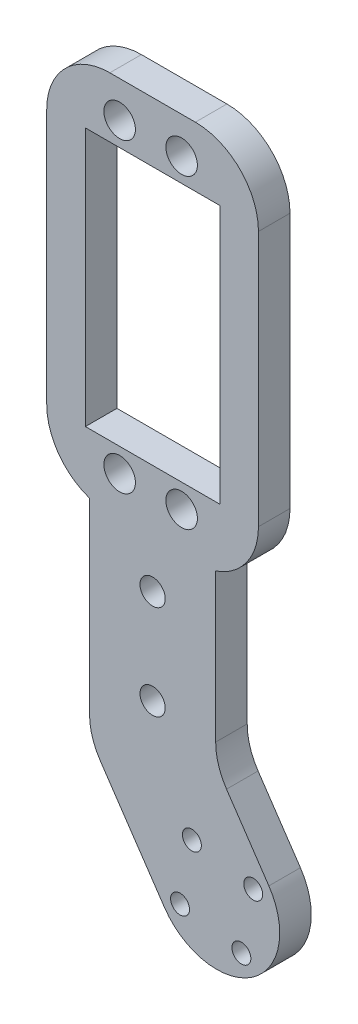
ISO-10303-21;
HEADER;
FILE_DESCRIPTION(('STEP AP214'),'2;1');
FILE_NAME('part.step','',(''),(''),'','','');
FILE_SCHEMA(('AUTOMOTIVE_DESIGN { 1 0 10303 214 1 1 1 1 }'));
ENDSEC;
DATA;
#1=APPLICATION_CONTEXT('core data for automotive mechanical design processes');
#2=APPLICATION_PROTOCOL_DEFINITION('international standard','automotive_design',2000,#1);
#3=PRODUCT_CONTEXT('',#1,'mechanical');
#4=PRODUCT('Part','Part','',(#3));
#5=PRODUCT_RELATED_PRODUCT_CATEGORY('part','',(#4));
#6=PRODUCT_DEFINITION_FORMATION('','',#4);
#7=PRODUCT_DEFINITION_CONTEXT('part definition',#1,'design');
#8=PRODUCT_DEFINITION('design','',#6,#7);
#9=PRODUCT_DEFINITION_SHAPE('','',#8);
#10=(LENGTH_UNIT() NAMED_UNIT(*) SI_UNIT(.MILLI.,.METRE.));
#11=(NAMED_UNIT(*) PLANE_ANGLE_UNIT() SI_UNIT($,.RADIAN.));
#12=(NAMED_UNIT(*) SI_UNIT($,.STERADIAN.) SOLID_ANGLE_UNIT());
#13=UNCERTAINTY_MEASURE_WITH_UNIT(LENGTH_MEASURE(1.E-05),#10,'distance_accuracy_value','');
#14=(GEOMETRIC_REPRESENTATION_CONTEXT(3) GLOBAL_UNCERTAINTY_ASSIGNED_CONTEXT((#13)) GLOBAL_UNIT_ASSIGNED_CONTEXT((#10,
#11,#12)) REPRESENTATION_CONTEXT('',''));
#15=CARTESIAN_POINT('',(0.,0.,0.));
#16=DIRECTION('',(0.,0.,1.));
#17=DIRECTION('',(1.,0.,0.));
#18=AXIS2_PLACEMENT_3D('',#15,#16,#17);
#19=CARTESIAN_POINT('',(-8.28208039522741,-5.60420773410388,5.));
#20=DIRECTION('',(0.828208039522741,0.560420773410388,0.));
#21=DIRECTION('',(-0.560420773410388,0.828208039522741,0.));
#22=AXIS2_PLACEMENT_3D('',#19,#20,#21);
#23=PLANE('',#22);
#24=DIRECTION('',(0.560420773410388,-0.828208039522741,0.));
#25=VECTOR('',#24,1.);
#26=CARTESIAN_POINT('',(-8.28208039522741,-5.60420773410388,5.));
#27=LINE('',#26,#25);
#28=CARTESIAN_POINT('',(-18.4320803952274,9.39579226589612,5.));
#29=VERTEX_POINT('',#28);
#30=CARTESIAN_POINT('',(-8.28208039522741,-5.60420773410389,5.));
#31=VERTEX_POINT('',#30);
#32=EDGE_CURVE('E236',#29,#31,#27,.T.);
#33=ORIENTED_EDGE('',*,*,#32,.F.);
#34=DIRECTION('',(0.,0.,-1.));
#35=VECTOR('',#34,1.);
#36=CARTESIAN_POINT('',(-18.4320803952274,9.39579226589612,0.));
#37=LINE('',#36,#35);
#38=CARTESIAN_POINT('',(-18.4320803952274,9.39579226589612,0.));
#39=VERTEX_POINT('',#38);
#40=EDGE_CURVE('E307',#29,#39,#37,.T.);
#41=ORIENTED_EDGE('',*,*,#40,.T.);
#42=DIRECTION('',(0.560420773410388,-0.828208039522741,0.));
#43=VECTOR('',#42,1.);
#44=CARTESIAN_POINT('',(-8.28208039522741,-5.60420773410388,0.));
#45=LINE('',#44,#43);
#46=CARTESIAN_POINT('',(-8.28208039522741,-5.60420773410389,0.));
#47=VERTEX_POINT('',#46);
#48=EDGE_CURVE('E235',#39,#47,#45,.T.);
#49=ORIENTED_EDGE('',*,*,#48,.T.);
#50=DIRECTION('',(0.,0.,-1.));
#51=VECTOR('',#50,1.);
#52=CARTESIAN_POINT('',(-8.28208039522741,-5.60420773410389,5.));
#53=LINE('',#52,#51);
#54=EDGE_CURVE('E266',#31,#47,#53,.T.);
#55=ORIENTED_EDGE('',*,*,#54,.F.);
#56=EDGE_LOOP('',(#33,#41,#49,#55));
#57=FACE_BOUND('',#56,.T.);
#58=ADVANCED_FACE('F47',(#57),#23,.F.);
#59=CARTESIAN_POINT('',(0.,0.,5.));
#60=DIRECTION('',(0.,0.,-1.));
#61=DIRECTION('',(-1.,0.,0.));
#62=AXIS2_PLACEMENT_3D('',#59,#60,#61);
#63=CYLINDRICAL_SURFACE('',#62,10.);
#64=CARTESIAN_POINT('',(0.,0.,0.));
#65=DIRECTION('',(0.,0.,1.));
#66=DIRECTION('',(1.,0.,0.));
#67=AXIS2_PLACEMENT_3D('',#64,#65,#66);
#68=CIRCLE('',#67,10.);
#69=CARTESIAN_POINT('',(8.28208039522741,5.60420773410388,0.));
#70=VERTEX_POINT('',#69);
#71=EDGE_CURVE('E253',#47,#70,#68,.T.);
#72=ORIENTED_EDGE('',*,*,#71,.T.);
#73=DIRECTION('',(0.,0.,-1.));
#74=VECTOR('',#73,1.);
#75=CARTESIAN_POINT('',(8.28208039522741,5.60420773410388,5.));
#76=LINE('',#75,#74);
#77=CARTESIAN_POINT('',(8.28208039522741,5.60420773410388,5.));
#78=VERTEX_POINT('',#77);
#79=EDGE_CURVE('E251',#78,#70,#76,.T.);
#80=ORIENTED_EDGE('',*,*,#79,.F.);
#81=CARTESIAN_POINT('',(0.,0.,5.));
#82=DIRECTION('',(0.,0.,1.));
#83=DIRECTION('',(1.,0.,0.));
#84=AXIS2_PLACEMENT_3D('',#81,#82,#83);
#85=CIRCLE('',#84,10.);
#86=EDGE_CURVE('E238',#31,#78,#85,.T.);
#87=ORIENTED_EDGE('',*,*,#86,.F.);
#88=ORIENTED_EDGE('',*,*,#54,.T.);
#89=EDGE_LOOP('',(#72,#80,#87,#88));
#90=FACE_BOUND('',#89,.T.);
#91=ADVANCED_FACE('F371',(#90),#63,.T.);
#92=CARTESIAN_POINT('',(8.28208039522741,5.60420773410388,5.));
#93=DIRECTION('',(0.828208039522741,0.560420773410388,0.));
#94=DIRECTION('',(-0.560420773410388,0.828208039522741,0.));
#95=AXIS2_PLACEMENT_3D('',#92,#93,#94);
#96=PLANE('',#95);
#97=DIRECTION('',(0.560420773410388,-0.828208039522741,0.));
#98=VECTOR('',#97,1.);
#99=CARTESIAN_POINT('',(8.28208039522741,5.60420773410388,0.));
#100=LINE('',#99,#98);
#101=CARTESIAN_POINT('',(1.56791960477259,15.5266128431504,0.));
#102=VERTEX_POINT('',#101);
#103=EDGE_CURVE('E256',#102,#70,#100,.T.);
#104=ORIENTED_EDGE('',*,*,#103,.F.);
#105=DIRECTION('',(0.,0.,-1.));
#106=VECTOR('',#105,1.);
#107=CARTESIAN_POINT('',(1.56791960477259,15.5266128431504,5.));
#108=LINE('',#107,#106);
#109=CARTESIAN_POINT('',(1.56791960477259,15.5266128431504,5.));
#110=VERTEX_POINT('',#109);
#111=EDGE_CURVE('E305',#102,#110,#108,.F.);
#112=ORIENTED_EDGE('',*,*,#111,.T.);
#113=DIRECTION('',(0.560420773410388,-0.828208039522741,0.));
#114=VECTOR('',#113,1.);
#115=CARTESIAN_POINT('',(8.28208039522741,5.60420773410388,5.));
#116=LINE('',#115,#114);
#117=EDGE_CURVE('E242',#110,#78,#116,.T.);
#118=ORIENTED_EDGE('',*,*,#117,.T.);
#119=ORIENTED_EDGE('',*,*,#79,.T.);
#120=EDGE_LOOP('',(#104,#112,#118,#119));
#121=FACE_BOUND('',#120,.T.);
#122=ADVANCED_FACE('F320',(#121),#96,.T.);
#123=CARTESIAN_POINT('',(-0.15,0.,5.));
#124=DIRECTION('',(-1.,0.,0.));
#125=DIRECTION('',(0.,-1.,0.));
#126=AXIS2_PLACEMENT_3D('',#123,#124,#125);
#127=PLANE('',#126);
#128=DIRECTION('',(0.,1.,0.));
#129=VECTOR('',#128,1.);
#130=CARTESIAN_POINT('',(-0.15,0.,5.));
#131=LINE('',#130,#129);
#132=CARTESIAN_POINT('',(-0.15,21.1308205772543,5.));
#133=VERTEX_POINT('',#132);
#134=CARTESIAN_POINT('',(-0.150000000000001,44.6203259783869,5.));
#135=VERTEX_POINT('',#134);
#136=EDGE_CURVE('E244',#133,#135,#131,.T.);
#137=ORIENTED_EDGE('',*,*,#136,.F.);
#138=DIRECTION('',(0.,0.,-1.));
#139=VECTOR('',#138,1.);
#140=CARTESIAN_POINT('',(-0.15,21.1308205772543,5.));
#141=LINE('',#140,#139);
#142=CARTESIAN_POINT('',(-0.15,21.1308205772543,0.));
#143=VERTEX_POINT('',#142);
#144=EDGE_CURVE('E302',#133,#143,#141,.T.);
#145=ORIENTED_EDGE('',*,*,#144,.T.);
#146=DIRECTION('',(0.,1.,0.));
#147=VECTOR('',#146,1.);
#148=CARTESIAN_POINT('',(-0.15,0.,0.));
#149=LINE('',#148,#147);
#150=CARTESIAN_POINT('',(-0.150000000000001,44.6203259783869,0.));
#151=VERTEX_POINT('',#150);
#152=EDGE_CURVE('E258',#143,#151,#149,.T.);
#153=ORIENTED_EDGE('',*,*,#152,.T.);
#154=DIRECTION('',(0.,0.,1.));
#155=VECTOR('',#154,1.);
#156=CARTESIAN_POINT('',(-0.15,44.6203259783869,5.));
#157=LINE('',#156,#155);
#158=EDGE_CURVE('E232',#151,#135,#157,.T.);
#159=ORIENTED_EDGE('',*,*,#158,.T.);
#160=EDGE_LOOP('',(#137,#145,#153,#159));
#161=FACE_BOUND('',#160,.T.);
#162=ADVANCED_FACE('F330',(#161),#127,.F.);
#163=CARTESIAN_POINT('',(0.,104.620325978387,5.));
#164=DIRECTION('',(0.,1.,0.));
#165=DIRECTION('',(0.,0.,1.));
#166=AXIS2_PLACEMENT_3D('',#163,#164,#165);
#167=PLANE('',#166);
#168=DIRECTION('',(1.,0.,0.));
#169=VECTOR('',#168,1.);
#170=CARTESIAN_POINT('',(0.,104.620325978387,0.));
#171=LINE('',#170,#169);
#172=CARTESIAN_POINT('',(-16.9293075053698,104.620325978387,0.));
#173=VERTEX_POINT('',#172);
#174=CARTESIAN_POINT('',(-3.37069249463012,104.620325978387,0.));
#175=VERTEX_POINT('',#174);
#176=EDGE_CURVE('E260',#173,#175,#171,.T.);
#177=ORIENTED_EDGE('',*,*,#176,.F.);
#178=DIRECTION('',(0.,0.,1.));
#179=VECTOR('',#178,1.);
#180=CARTESIAN_POINT('',(-16.9293075053698,104.620325978387,5.));
#181=LINE('',#180,#179);
#182=CARTESIAN_POINT('',(-16.9293075053698,104.620325978387,5.));
#183=VERTEX_POINT('',#182);
#184=EDGE_CURVE('E271',#173,#183,#181,.T.);
#185=ORIENTED_EDGE('',*,*,#184,.T.);
#186=DIRECTION('',(1.,0.,0.));
#187=VECTOR('',#186,1.);
#188=CARTESIAN_POINT('',(0.,104.620325978387,5.));
#189=LINE('',#188,#187);
#190=CARTESIAN_POINT('',(-3.37069249463012,104.620325978387,5.));
#191=VERTEX_POINT('',#190);
#192=EDGE_CURVE('E246',#183,#191,#189,.T.);
#193=ORIENTED_EDGE('',*,*,#192,.T.);
#194=DIRECTION('',(0.,0.,1.));
#195=VECTOR('',#194,1.);
#196=CARTESIAN_POINT('',(-3.37069249463012,104.620325978387,5.));
#197=LINE('',#196,#195);
#198=EDGE_CURVE('E269',#191,#175,#197,.F.);
#199=ORIENTED_EDGE('',*,*,#198,.T.);
#200=EDGE_LOOP('',(#177,#185,#193,#199));
#201=FACE_BOUND('',#200,.T.);
#202=ADVANCED_FACE('F348',(#201),#167,.T.);
#203=CARTESIAN_POINT('',(-20.15,0.,5.));
#204=DIRECTION('',(-1.,0.,0.));
#205=DIRECTION('',(0.,0.,1.));
#206=AXIS2_PLACEMENT_3D('',#203,#204,#205);
#207=PLANE('',#206);
#208=DIRECTION('',(0.,1.,0.));
#209=VECTOR('',#208,1.);
#210=CARTESIAN_POINT('',(-20.15,0.,0.));
#211=LINE('',#210,#209);
#212=CARTESIAN_POINT('',(-20.15,15.,0.));
#213=VERTEX_POINT('',#212);
#214=CARTESIAN_POINT('',(-20.15,44.6203259783869,0.));
#215=VERTEX_POINT('',#214);
#216=EDGE_CURVE('E239',#213,#215,#211,.T.);
#217=ORIENTED_EDGE('',*,*,#216,.F.);
#218=DIRECTION('',(0.,0.,-1.));
#219=VECTOR('',#218,1.);
#220=CARTESIAN_POINT('',(-20.15,15.,5.));
#221=LINE('',#220,#219);
#222=CARTESIAN_POINT('',(-20.15,15.,5.));
#223=VERTEX_POINT('',#222);
#224=EDGE_CURVE('E62',#213,#223,#221,.F.);
#225=ORIENTED_EDGE('',*,*,#224,.T.);
#226=DIRECTION('',(0.,1.,0.));
#227=VECTOR('',#226,1.);
#228=CARTESIAN_POINT('',(-20.15,0.,5.));
#229=LINE('',#228,#227);
#230=CARTESIAN_POINT('',(-20.15,44.6203259783869,5.));
#231=VERTEX_POINT('',#230);
#232=EDGE_CURVE('E249',#223,#231,#229,.T.);
#233=ORIENTED_EDGE('',*,*,#232,.T.);
#234=DIRECTION('',(0.,0.,1.));
#235=VECTOR('',#234,1.);
#236=CARTESIAN_POINT('',(-20.15,44.6203259783869,5.));
#237=LINE('',#236,#235);
#238=EDGE_CURVE('E225',#215,#231,#237,.T.);
#239=ORIENTED_EDGE('',*,*,#238,.F.);
#240=EDGE_LOOP('',(#217,#225,#233,#239));
#241=FACE_BOUND('',#240,.T.);
#242=ADVANCED_FACE('F456',(#241),#207,.T.);
#243=CARTESIAN_POINT('',(0.,0.,5.));
#244=DIRECTION('',(0.,0.,1.));
#245=DIRECTION('',(1.,0.,0.));
#246=AXIS2_PLACEMENT_3D('',#243,#244,#245);
#247=PLANE('',#246);
#248=CARTESIAN_POINT('',(5.7974562766592,3.9229454138727,5.));
#249=DIRECTION('',(0.,0.,1.));
#250=DIRECTION('',(1.,0.,0.));
#251=AXIS2_PLACEMENT_3D('',#248,#249,#250);
#252=CIRCLE('',#251,1.5);
#253=CARTESIAN_POINT('',(7.2974562766592,3.9229454138727,5.));
#254=VERTEX_POINT('',#253);
#255=EDGE_CURVE('E725',#254,#254,#252,.T.);
#256=ORIENTED_EDGE('',*,*,#255,.F.);
#257=EDGE_LOOP('',(#256));
#258=FACE_BOUND('',#257,.T.);
#259=CARTESIAN_POINT('',(3.92294541387272,-5.79745627665919,5.));
#260=DIRECTION('',(0.,0.,1.));
#261=DIRECTION('',(1.,0.,0.));
#262=AXIS2_PLACEMENT_3D('',#259,#260,#261);
#263=CIRCLE('',#262,1.5);
#264=CARTESIAN_POINT('',(5.42294541387272,-5.79745627665919,5.));
#265=VERTEX_POINT('',#264);
#266=EDGE_CURVE('E721',#265,#265,#263,.T.);
#267=ORIENTED_EDGE('',*,*,#266,.F.);
#268=EDGE_LOOP('',(#267));
#269=FACE_BOUND('',#268,.T.);
#270=CARTESIAN_POINT('',(-5.79745627665891,-3.92294541387277,5.));
#271=DIRECTION('',(0.,0.,1.));
#272=DIRECTION('',(1.,0.,0.));
#273=AXIS2_PLACEMENT_3D('',#270,#271,#272);
#274=CIRCLE('',#273,1.5);
#275=CARTESIAN_POINT('',(-4.29745627665891,-3.92294541387277,5.));
#276=VERTEX_POINT('',#275);
#277=EDGE_CURVE('E717',#276,#276,#274,.T.);
#278=ORIENTED_EDGE('',*,*,#277,.F.);
#279=EDGE_LOOP('',(#278));
#280=FACE_BOUND('',#279,.T.);
#281=CARTESIAN_POINT('',(-10.15,21.7974562766592,5.));
#282=DIRECTION('',(0.,0.,1.));
#283=DIRECTION('',(1.,0.,0.));
#284=AXIS2_PLACEMENT_3D('',#281,#282,#283);
#285=CIRCLE('',#284,2.);
#286=CARTESIAN_POINT('',(-8.14999999999999,21.7974562766592,5.));
#287=VERTEX_POINT('',#286);
#288=EDGE_CURVE('E713',#287,#287,#285,.T.);
#289=ORIENTED_EDGE('',*,*,#288,.F.);
#290=EDGE_LOOP('',(#289));
#291=FACE_BOUND('',#290,.T.);
#292=CARTESIAN_POINT('',(-10.15,36.7974562766592,5.));
#293=DIRECTION('',(0.,0.,1.));
#294=DIRECTION('',(1.,0.,0.));
#295=AXIS2_PLACEMENT_3D('',#292,#293,#294);
#296=CIRCLE('',#295,2.);
#297=CARTESIAN_POINT('',(-8.15,36.7974562766592,5.));
#298=VERTEX_POINT('',#297);
#299=EDGE_CURVE('E709',#298,#298,#296,.T.);
#300=ORIENTED_EDGE('',*,*,#299,.F.);
#301=EDGE_LOOP('',(#300));
#302=FACE_BOUND('',#301,.T.);
#303=CARTESIAN_POINT('',(-3.92294541387272,5.79745627665919,5.));
#304=DIRECTION('',(0.,0.,1.));
#305=DIRECTION('',(1.,0.,0.));
#306=AXIS2_PLACEMENT_3D('',#303,#304,#305);
#307=CIRCLE('',#306,1.5);
#308=CARTESIAN_POINT('',(-2.42294541387272,5.79745627665919,5.));
#309=VERTEX_POINT('',#308);
#310=EDGE_CURVE('E705',#309,#309,#307,.T.);
#311=ORIENTED_EDGE('',*,*,#310,.F.);
#312=EDGE_LOOP('',(#311));
#313=FACE_BOUND('',#312,.T.);
#314=CARTESIAN_POINT('',(-15.3737237098508,50.3703259783869,5.));
#315=DIRECTION('',(0.,0.,1.));
#316=DIRECTION('',(1.,0.,0.));
#317=AXIS2_PLACEMENT_3D('',#314,#315,#316);
#318=CIRCLE('',#317,2.5);
#319=CARTESIAN_POINT('',(-12.8737237098508,50.3703259783869,5.));
#320=VERTEX_POINT('',#319);
#321=EDGE_CURVE('E701',#320,#320,#318,.T.);
#322=ORIENTED_EDGE('',*,*,#321,.F.);
#323=EDGE_LOOP('',(#322));
#324=FACE_BOUND('',#323,.T.);
#325=CARTESIAN_POINT('',(-5.54999999999958,50.3703259783869,5.));
#326=DIRECTION('',(0.,0.,1.));
#327=DIRECTION('',(1.,0.,0.));
#328=AXIS2_PLACEMENT_3D('',#325,#326,#327);
#329=CIRCLE('',#328,2.50000000000012);
#330=CARTESIAN_POINT('',(-3.04999999999946,50.3703259783869,5.));
#331=VERTEX_POINT('',#330);
#332=EDGE_CURVE('E697',#331,#331,#329,.T.);
#333=ORIENTED_EDGE('',*,*,#332,.F.);
#334=EDGE_LOOP('',(#333));
#335=FACE_BOUND('',#334,.T.);
#336=CARTESIAN_POINT('',(-15.3737237098508,98.8703259783869,5.));
#337=DIRECTION('',(0.,0.,1.));
#338=DIRECTION('',(1.,0.,0.));
#339=AXIS2_PLACEMENT_3D('',#336,#337,#338);
#340=CIRCLE('',#339,2.49999999999999);
#341=CARTESIAN_POINT('',(-12.8737237098508,98.8703259783869,5.));
#342=VERTEX_POINT('',#341);
#343=EDGE_CURVE('E691',#342,#342,#340,.T.);
#344=ORIENTED_EDGE('',*,*,#343,.F.);
#345=EDGE_LOOP('',(#344));
#346=FACE_BOUND('',#345,.T.);
#347=CARTESIAN_POINT('',(-5.54999999999958,98.8703259783869,5.));
#348=DIRECTION('',(0.,0.,1.));
#349=DIRECTION('',(1.,0.,0.));
#350=AXIS2_PLACEMENT_3D('',#347,#348,#349);
#351=CIRCLE('',#350,2.5);
#352=CARTESIAN_POINT('',(-3.04999999999958,98.8703259783869,5.));
#353=VERTEX_POINT('',#352);
#354=EDGE_CURVE('E201',#353,#353,#351,.T.);
#355=ORIENTED_EDGE('',*,*,#354,.F.);
#356=EDGE_LOOP('',(#355));
#357=FACE_BOUND('',#356,.T.);
#358=DIRECTION('',(0.,-1.,0.));
#359=VECTOR('',#358,1.);
#360=CARTESIAN_POINT('',(-20.8,54.1203259783869,5.));
#361=LINE('',#360,#359);
#362=CARTESIAN_POINT('',(-20.8,95.1203259783869,5.));
#363=VERTEX_POINT('',#362);
#364=CARTESIAN_POINT('',(-20.8,54.1203259783869,5.));
#365=VERTEX_POINT('',#364);
#366=EDGE_CURVE('E178',#363,#365,#361,.T.);
#367=ORIENTED_EDGE('',*,*,#366,.F.);
#368=DIRECTION('',(-1.,0.,0.));
#369=VECTOR('',#368,1.);
#370=CARTESIAN_POINT('',(0.499999999999995,95.1203259783869,5.));
#371=LINE('',#370,#369);
#372=CARTESIAN_POINT('',(0.499999999999995,95.1203259783869,5.));
#373=VERTEX_POINT('',#372);
#374=EDGE_CURVE('E195',#373,#363,#371,.T.);
#375=ORIENTED_EDGE('',*,*,#374,.F.);
#376=DIRECTION('',(0.,1.,0.));
#377=VECTOR('',#376,1.);
#378=CARTESIAN_POINT('',(0.500000000000005,54.1203259783869,5.));
#379=LINE('',#378,#377);
#380=CARTESIAN_POINT('',(0.500000000000005,54.1203259783869,5.));
#381=VERTEX_POINT('',#380);
#382=EDGE_CURVE('E198',#381,#373,#379,.T.);
#383=ORIENTED_EDGE('',*,*,#382,.F.);
#384=DIRECTION('',(1.,0.,0.));
#385=VECTOR('',#384,1.);
#386=CARTESIAN_POINT('',(0.500000000000005,54.1203259783869,5.));
#387=LINE('',#386,#385);
#388=EDGE_CURVE('E207',#365,#381,#387,.T.);
#389=ORIENTED_EDGE('',*,*,#388,.F.);
#390=EDGE_LOOP('',(#367,#375,#383,#389));
#391=FACE_BOUND('',#390,.T.);
#392=ORIENTED_EDGE('',*,*,#232,.F.);
#393=CARTESIAN_POINT('',(-10.15,15.,5.));
#394=DIRECTION('',(0.,0.,1.));
#395=DIRECTION('',(1.,0.,0.));
#396=AXIS2_PLACEMENT_3D('',#393,#394,#395);
#397=CIRCLE('',#396,10.);
#398=EDGE_CURVE('E312',#223,#29,#397,.T.);
#399=ORIENTED_EDGE('',*,*,#398,.T.);
#400=ORIENTED_EDGE('',*,*,#32,.T.);
#401=ORIENTED_EDGE('',*,*,#86,.T.);
#402=ORIENTED_EDGE('',*,*,#117,.F.);
#403=CARTESIAN_POINT('',(9.85,21.1308205772543,5.));
#404=DIRECTION('',(0.,0.,1.));
#405=DIRECTION('',(1.,0.,0.));
#406=AXIS2_PLACEMENT_3D('',#403,#404,#405);
#407=CIRCLE('',#406,10.);
#408=EDGE_CURVE('E13',#110,#133,#407,.F.);
#409=ORIENTED_EDGE('',*,*,#408,.T.);
#410=ORIENTED_EDGE('',*,*,#136,.T.);
#411=CARTESIAN_POINT('',(-3.37069249463012,54.0874871080515,5.));
#412=DIRECTION('',(0.,0.,1.));
#413=DIRECTION('',(1.,0.,0.));
#414=AXIS2_PLACEMENT_3D('',#411,#412,#413);
#415=CIRCLE('',#414,10.);
#416=CARTESIAN_POINT('',(6.62930750536989,54.0874871080515,5.));
#417=VERTEX_POINT('',#416);
#418=EDGE_CURVE('E277',#135,#417,#415,.T.);
#419=ORIENTED_EDGE('',*,*,#418,.T.);
#420=DIRECTION('',(0.,1.,0.));
#421=VECTOR('',#420,1.);
#422=CARTESIAN_POINT('',(6.62930750536989,44.6203259783869,5.));
#423=LINE('',#422,#421);
#424=CARTESIAN_POINT('',(6.62930750536989,94.6203259783869,5.));
#425=VERTEX_POINT('',#424);
#426=EDGE_CURVE('E222',#417,#425,#423,.T.);
#427=ORIENTED_EDGE('',*,*,#426,.T.);
#428=CARTESIAN_POINT('',(-3.37069249463012,94.6203259783869,5.));
#429=DIRECTION('',(0.,0.,1.));
#430=DIRECTION('',(1.,0.,0.));
#431=AXIS2_PLACEMENT_3D('',#428,#429,#430);
#432=CIRCLE('',#431,10.);
#433=EDGE_CURVE('E279',#425,#191,#432,.T.);
#434=ORIENTED_EDGE('',*,*,#433,.T.);
#435=ORIENTED_EDGE('',*,*,#192,.F.);
#436=CARTESIAN_POINT('',(-16.9293075053698,94.6203259783869,5.));
#437=DIRECTION('',(0.,0.,1.));
#438=DIRECTION('',(1.,0.,0.));
#439=AXIS2_PLACEMENT_3D('',#436,#437,#438);
#440=CIRCLE('',#439,10.);
#441=CARTESIAN_POINT('',(-26.9293075053698,94.6203259783869,5.));
#442=VERTEX_POINT('',#441);
#443=EDGE_CURVE('E281',#183,#442,#440,.T.);
#444=ORIENTED_EDGE('',*,*,#443,.T.);
#445=DIRECTION('',(0.,-1.,0.));
#446=VECTOR('',#445,1.);
#447=CARTESIAN_POINT('',(-26.9293075053698,44.6203259783869,5.));
#448=LINE('',#447,#446);
#449=CARTESIAN_POINT('',(-26.9293075053698,54.0874871080515,5.));
#450=VERTEX_POINT('',#449);
#451=EDGE_CURVE('E214',#442,#450,#448,.T.);
#452=ORIENTED_EDGE('',*,*,#451,.T.);
#453=CARTESIAN_POINT('',(-16.9293075053698,54.0874871080515,5.));
#454=DIRECTION('',(0.,0.,1.));
#455=DIRECTION('',(1.,0.,0.));
#456=AXIS2_PLACEMENT_3D('',#453,#454,#455);
#457=CIRCLE('',#456,10.);
#458=EDGE_CURVE('E274',#450,#231,#457,.T.);
#459=ORIENTED_EDGE('',*,*,#458,.T.);
#460=EDGE_LOOP('',(#392,#399,#400,#401,#402,#409,#410,#419,#427,#434,#435,#444,#452,#459));
#461=FACE_BOUND('',#460,.T.);
#462=ADVANCED_FACE('F327',(#258,#269,#280,#291,#302,#313,#324,#335,#346,#357,#391,#461),#247,.T.);
#463=CARTESIAN_POINT('',(0.,0.,0.));
#464=DIRECTION('',(0.,0.,1.));
#465=DIRECTION('',(1.,0.,0.));
#466=AXIS2_PLACEMENT_3D('',#463,#464,#465);
#467=PLANE('',#466);
#468=CARTESIAN_POINT('',(5.7974562766592,3.9229454138727,0.));
#469=DIRECTION('',(0.,0.,1.));
#470=DIRECTION('',(1.,0.,0.));
#471=AXIS2_PLACEMENT_3D('',#468,#469,#470);
#472=CIRCLE('',#471,1.5);
#473=CARTESIAN_POINT('',(7.2974562766592,3.9229454138727,0.));
#474=VERTEX_POINT('',#473);
#475=EDGE_CURVE('E656',#474,#474,#472,.T.);
#476=ORIENTED_EDGE('',*,*,#475,.T.);
#477=EDGE_LOOP('',(#476));
#478=FACE_BOUND('',#477,.T.);
#479=CARTESIAN_POINT('',(3.92294541387272,-5.79745627665919,0.));
#480=DIRECTION('',(0.,0.,1.));
#481=DIRECTION('',(1.,0.,0.));
#482=AXIS2_PLACEMENT_3D('',#479,#480,#481);
#483=CIRCLE('',#482,1.5);
#484=CARTESIAN_POINT('',(5.42294541387272,-5.79745627665919,0.));
#485=VERTEX_POINT('',#484);
#486=EDGE_CURVE('E660',#485,#485,#483,.T.);
#487=ORIENTED_EDGE('',*,*,#486,.T.);
#488=EDGE_LOOP('',(#487));
#489=FACE_BOUND('',#488,.T.);
#490=CARTESIAN_POINT('',(-5.79745627665891,-3.92294541387277,0.));
#491=DIRECTION('',(0.,0.,1.));
#492=DIRECTION('',(1.,0.,0.));
#493=AXIS2_PLACEMENT_3D('',#490,#491,#492);
#494=CIRCLE('',#493,1.5);
#495=CARTESIAN_POINT('',(-4.29745627665891,-3.92294541387277,0.));
#496=VERTEX_POINT('',#495);
#497=EDGE_CURVE('E664',#496,#496,#494,.T.);
#498=ORIENTED_EDGE('',*,*,#497,.T.);
#499=EDGE_LOOP('',(#498));
#500=FACE_BOUND('',#499,.T.);
#501=CARTESIAN_POINT('',(-10.15,21.7974562766592,0.));
#502=DIRECTION('',(0.,0.,1.));
#503=DIRECTION('',(1.,0.,0.));
#504=AXIS2_PLACEMENT_3D('',#501,#502,#503);
#505=CIRCLE('',#504,2.);
#506=CARTESIAN_POINT('',(-8.14999999999999,21.7974562766592,0.));
#507=VERTEX_POINT('',#506);
#508=EDGE_CURVE('E668',#507,#507,#505,.T.);
#509=ORIENTED_EDGE('',*,*,#508,.T.);
#510=EDGE_LOOP('',(#509));
#511=FACE_BOUND('',#510,.T.);
#512=CARTESIAN_POINT('',(-10.15,36.7974562766592,0.));
#513=DIRECTION('',(0.,0.,1.));
#514=DIRECTION('',(1.,0.,0.));
#515=AXIS2_PLACEMENT_3D('',#512,#513,#514);
#516=CIRCLE('',#515,2.);
#517=CARTESIAN_POINT('',(-8.15,36.7974562766592,0.));
#518=VERTEX_POINT('',#517);
#519=EDGE_CURVE('E672',#518,#518,#516,.T.);
#520=ORIENTED_EDGE('',*,*,#519,.T.);
#521=EDGE_LOOP('',(#520));
#522=FACE_BOUND('',#521,.T.);
#523=CARTESIAN_POINT('',(-3.92294541387272,5.79745627665919,0.));
#524=DIRECTION('',(0.,0.,1.));
#525=DIRECTION('',(1.,0.,0.));
#526=AXIS2_PLACEMENT_3D('',#523,#524,#525);
#527=CIRCLE('',#526,1.5);
#528=CARTESIAN_POINT('',(-2.42294541387272,5.79745627665919,0.));
#529=VERTEX_POINT('',#528);
#530=EDGE_CURVE('E676',#529,#529,#527,.T.);
#531=ORIENTED_EDGE('',*,*,#530,.T.);
#532=EDGE_LOOP('',(#531));
#533=FACE_BOUND('',#532,.T.);
#534=CARTESIAN_POINT('',(-15.3737237098508,50.3703259783869,0.));
#535=DIRECTION('',(0.,0.,1.));
#536=DIRECTION('',(1.,0.,0.));
#537=AXIS2_PLACEMENT_3D('',#534,#535,#536);
#538=CIRCLE('',#537,2.5);
#539=CARTESIAN_POINT('',(-12.8737237098508,50.3703259783869,0.));
#540=VERTEX_POINT('',#539);
#541=EDGE_CURVE('E208',#540,#540,#538,.T.);
#542=ORIENTED_EDGE('',*,*,#541,.T.);
#543=EDGE_LOOP('',(#542));
#544=FACE_BOUND('',#543,.T.);
#545=CARTESIAN_POINT('',(-5.54999999999958,50.3703259783869,0.));
#546=DIRECTION('',(0.,0.,1.));
#547=DIRECTION('',(1.,0.,0.));
#548=AXIS2_PLACEMENT_3D('',#545,#546,#547);
#549=CIRCLE('',#548,2.50000000000012);
#550=CARTESIAN_POINT('',(-3.04999999999946,50.3703259783869,0.));
#551=VERTEX_POINT('',#550);
#552=EDGE_CURVE('E683',#551,#551,#549,.T.);
#553=ORIENTED_EDGE('',*,*,#552,.T.);
#554=EDGE_LOOP('',(#553));
#555=FACE_BOUND('',#554,.T.);
#556=CARTESIAN_POINT('',(-15.3737237098508,98.8703259783869,0.));
#557=DIRECTION('',(0.,0.,1.));
#558=DIRECTION('',(1.,0.,0.));
#559=AXIS2_PLACEMENT_3D('',#556,#557,#558);
#560=CIRCLE('',#559,2.49999999999999);
#561=CARTESIAN_POINT('',(-12.8737237098508,98.8703259783869,0.));
#562=VERTEX_POINT('',#561);
#563=EDGE_CURVE('E687',#562,#562,#560,.T.);
#564=ORIENTED_EDGE('',*,*,#563,.T.);
#565=EDGE_LOOP('',(#564));
#566=FACE_BOUND('',#565,.T.);
#567=CARTESIAN_POINT('',(-5.54999999999958,98.8703259783869,0.));
#568=DIRECTION('',(0.,0.,1.));
#569=DIRECTION('',(1.,0.,0.));
#570=AXIS2_PLACEMENT_3D('',#567,#568,#569);
#571=CIRCLE('',#570,2.5);
#572=CARTESIAN_POINT('',(-3.04999999999958,98.8703259783869,0.));
#573=VERTEX_POINT('',#572);
#574=EDGE_CURVE('E690',#573,#573,#571,.T.);
#575=ORIENTED_EDGE('',*,*,#574,.T.);
#576=EDGE_LOOP('',(#575));
#577=FACE_BOUND('',#576,.T.);
#578=DIRECTION('',(-1.,0.,0.));
#579=VECTOR('',#578,1.);
#580=CARTESIAN_POINT('',(0.499999999999995,95.1203259783869,0.));
#581=LINE('',#580,#579);
#582=CARTESIAN_POINT('',(0.499999999999995,95.1203259783869,0.));
#583=VERTEX_POINT('',#582);
#584=CARTESIAN_POINT('',(-20.8,95.1203259783869,0.));
#585=VERTEX_POINT('',#584);
#586=EDGE_CURVE('E183',#583,#585,#581,.T.);
#587=ORIENTED_EDGE('',*,*,#586,.T.);
#588=DIRECTION('',(0.,-1.,0.));
#589=VECTOR('',#588,1.);
#590=CARTESIAN_POINT('',(-20.8,54.1203259783869,0.));
#591=LINE('',#590,#589);
#592=CARTESIAN_POINT('',(-20.8,54.1203259783869,0.));
#593=VERTEX_POINT('',#592);
#594=EDGE_CURVE('E175',#585,#593,#591,.T.);
#595=ORIENTED_EDGE('',*,*,#594,.T.);
#596=DIRECTION('',(1.,0.,0.));
#597=VECTOR('',#596,1.);
#598=CARTESIAN_POINT('',(0.500000000000005,54.1203259783869,0.));
#599=LINE('',#598,#597);
#600=CARTESIAN_POINT('',(0.500000000000005,54.1203259783869,0.));
#601=VERTEX_POINT('',#600);
#602=EDGE_CURVE('E187',#593,#601,#599,.T.);
#603=ORIENTED_EDGE('',*,*,#602,.T.);
#604=DIRECTION('',(0.,1.,0.));
#605=VECTOR('',#604,1.);
#606=CARTESIAN_POINT('',(0.500000000000005,54.1203259783869,0.));
#607=LINE('',#606,#605);
#608=EDGE_CURVE('E191',#601,#583,#607,.T.);
#609=ORIENTED_EDGE('',*,*,#608,.T.);
#610=EDGE_LOOP('',(#587,#595,#603,#609));
#611=FACE_BOUND('',#610,.T.);
#612=ORIENTED_EDGE('',*,*,#48,.F.);
#613=CARTESIAN_POINT('',(-10.15,15.,0.));
#614=DIRECTION('',(0.,0.,1.));
#615=DIRECTION('',(1.,0.,0.));
#616=AXIS2_PLACEMENT_3D('',#613,#614,#615);
#617=CIRCLE('',#616,10.);
#618=EDGE_CURVE('E70',#39,#213,#617,.F.);
#619=ORIENTED_EDGE('',*,*,#618,.T.);
#620=ORIENTED_EDGE('',*,*,#216,.T.);
#621=CARTESIAN_POINT('',(-16.9293075053698,54.0874871080515,0.));
#622=DIRECTION('',(0.,0.,1.));
#623=DIRECTION('',(1.,0.,0.));
#624=AXIS2_PLACEMENT_3D('',#621,#622,#623);
#625=CIRCLE('',#624,10.);
#626=CARTESIAN_POINT('',(-26.9293075053698,54.0874871080515,0.));
#627=VERTEX_POINT('',#626);
#628=EDGE_CURVE('E288',#215,#627,#625,.F.);
#629=ORIENTED_EDGE('',*,*,#628,.T.);
#630=DIRECTION('',(0.,-1.,0.));
#631=VECTOR('',#630,1.);
#632=CARTESIAN_POINT('',(-26.9293075053698,44.6203259783869,0.));
#633=LINE('',#632,#631);
#634=CARTESIAN_POINT('',(-26.9293075053698,94.6203259783869,0.));
#635=VERTEX_POINT('',#634);
#636=EDGE_CURVE('E218',#635,#627,#633,.T.);
#637=ORIENTED_EDGE('',*,*,#636,.F.);
#638=CARTESIAN_POINT('',(-16.9293075053698,94.6203259783869,0.));
#639=DIRECTION('',(0.,0.,1.));
#640=DIRECTION('',(1.,0.,0.));
#641=AXIS2_PLACEMENT_3D('',#638,#639,#640);
#642=CIRCLE('',#641,10.);
#643=EDGE_CURVE('E295',#635,#173,#642,.F.);
#644=ORIENTED_EDGE('',*,*,#643,.T.);
#645=ORIENTED_EDGE('',*,*,#176,.T.);
#646=CARTESIAN_POINT('',(-3.37069249463012,94.6203259783869,0.));
#647=DIRECTION('',(0.,0.,1.));
#648=DIRECTION('',(1.,0.,0.));
#649=AXIS2_PLACEMENT_3D('',#646,#647,#648);
#650=CIRCLE('',#649,10.);
#651=CARTESIAN_POINT('',(6.62930750536989,94.6203259783869,0.));
#652=VERTEX_POINT('',#651);
#653=EDGE_CURVE('E293',#175,#652,#650,.F.);
#654=ORIENTED_EDGE('',*,*,#653,.T.);
#655=DIRECTION('',(0.,1.,0.));
#656=VECTOR('',#655,1.);
#657=CARTESIAN_POINT('',(6.62930750536989,44.6203259783869,0.));
#658=LINE('',#657,#656);
#659=CARTESIAN_POINT('',(6.62930750536989,54.0874871080515,0.));
#660=VERTEX_POINT('',#659);
#661=EDGE_CURVE('E221',#660,#652,#658,.T.);
#662=ORIENTED_EDGE('',*,*,#661,.F.);
#663=CARTESIAN_POINT('',(-3.37069249463012,54.0874871080515,0.));
#664=DIRECTION('',(0.,0.,1.));
#665=DIRECTION('',(1.,0.,0.));
#666=AXIS2_PLACEMENT_3D('',#663,#664,#665);
#667=CIRCLE('',#666,10.);
#668=EDGE_CURVE('E290',#660,#151,#667,.F.);
#669=ORIENTED_EDGE('',*,*,#668,.T.);
#670=ORIENTED_EDGE('',*,*,#152,.F.);
#671=CARTESIAN_POINT('',(9.85,21.1308205772543,0.));
#672=DIRECTION('',(0.,0.,1.));
#673=DIRECTION('',(1.,0.,0.));
#674=AXIS2_PLACEMENT_3D('',#671,#672,#673);
#675=CIRCLE('',#674,10.);
#676=EDGE_CURVE('E55',#143,#102,#675,.T.);
#677=ORIENTED_EDGE('',*,*,#676,.T.);
#678=ORIENTED_EDGE('',*,*,#103,.T.);
#679=ORIENTED_EDGE('',*,*,#71,.F.);
#680=EDGE_LOOP('',(#612,#619,#620,#629,#637,#644,#645,#654,#662,#669,#670,#677,#678,#679));
#681=FACE_BOUND('',#680,.T.);
#682=ADVANCED_FACE('F193',(#478,#489,#500,#511,#522,#533,#544,#555,#566,#577,#611,#681),#467,.F.);
#683=CARTESIAN_POINT('',(-26.9293075053698,44.6203259783869,0.));
#684=DIRECTION('',(-1.,0.,0.));
#685=DIRECTION('',(0.,-1.,0.));
#686=AXIS2_PLACEMENT_3D('',#683,#684,#685);
#687=PLANE('',#686);
#688=ORIENTED_EDGE('',*,*,#451,.F.);
#689=DIRECTION('',(0.,0.,1.));
#690=VECTOR('',#689,1.);
#691=CARTESIAN_POINT('',(-26.9293075053698,94.6203259783869,0.));
#692=LINE('',#691,#690);
#693=EDGE_CURVE('E286',#442,#635,#692,.F.);
#694=ORIENTED_EDGE('',*,*,#693,.T.);
#695=ORIENTED_EDGE('',*,*,#636,.T.);
#696=DIRECTION('',(0.,0.,1.));
#697=VECTOR('',#696,1.);
#698=CARTESIAN_POINT('',(-26.9293075053698,54.0874871080515,5.));
#699=LINE('',#698,#697);
#700=EDGE_CURVE('E283',#627,#450,#699,.T.);
#701=ORIENTED_EDGE('',*,*,#700,.T.);
#702=EDGE_LOOP('',(#688,#694,#695,#701));
#703=FACE_BOUND('',#702,.T.);
#704=ADVANCED_FACE('F356',(#703),#687,.T.);
#705=CARTESIAN_POINT('',(6.62930750536989,44.6203259783869,0.));
#706=DIRECTION('',(1.,0.,0.));
#707=DIRECTION('',(0.,0.,-1.));
#708=AXIS2_PLACEMENT_3D('',#705,#706,#707);
#709=PLANE('',#708);
#710=ORIENTED_EDGE('',*,*,#661,.T.);
#711=DIRECTION('',(0.,0.,1.));
#712=VECTOR('',#711,1.);
#713=CARTESIAN_POINT('',(6.62930750536989,94.6203259783869,0.));
#714=LINE('',#713,#712);
#715=EDGE_CURVE('E299',#652,#425,#714,.T.);
#716=ORIENTED_EDGE('',*,*,#715,.T.);
#717=ORIENTED_EDGE('',*,*,#426,.F.);
#718=DIRECTION('',(0.,0.,1.));
#719=VECTOR('',#718,1.);
#720=CARTESIAN_POINT('',(6.62930750536989,54.0874871080515,0.));
#721=LINE('',#720,#719);
#722=EDGE_CURVE('E297',#417,#660,#721,.F.);
#723=ORIENTED_EDGE('',*,*,#722,.T.);
#724=EDGE_LOOP('',(#710,#716,#717,#723));
#725=FACE_BOUND('',#724,.T.);
#726=ADVANCED_FACE('F338',(#725),#709,.T.);
#727=CARTESIAN_POINT('',(-20.8,54.1203259783869,0.));
#728=DIRECTION('',(-1.,0.,0.));
#729=DIRECTION('',(0.,-1.,0.));
#730=AXIS2_PLACEMENT_3D('',#727,#728,#729);
#731=PLANE('',#730);
#732=ORIENTED_EDGE('',*,*,#366,.T.);
#733=DIRECTION('',(0.,0.,1.));
#734=VECTOR('',#733,1.);
#735=CARTESIAN_POINT('',(-20.8,54.1203259783869,0.));
#736=LINE('',#735,#734);
#737=EDGE_CURVE('E171',#593,#365,#736,.T.);
#738=ORIENTED_EDGE('',*,*,#737,.F.);
#739=ORIENTED_EDGE('',*,*,#594,.F.);
#740=DIRECTION('',(0.,0.,1.));
#741=VECTOR('',#740,1.);
#742=CARTESIAN_POINT('',(-20.8,95.1203259783869,0.));
#743=LINE('',#742,#741);
#744=EDGE_CURVE('E212',#585,#363,#743,.T.);
#745=ORIENTED_EDGE('',*,*,#744,.T.);
#746=EDGE_LOOP('',(#732,#738,#739,#745));
#747=FACE_BOUND('',#746,.T.);
#748=ADVANCED_FACE('F173',(#747),#731,.F.);
#749=CARTESIAN_POINT('',(0.499999999999995,95.1203259783869,0.));
#750=DIRECTION('',(0.,1.,0.));
#751=DIRECTION('',(-1.,0.,0.));
#752=AXIS2_PLACEMENT_3D('',#749,#750,#751);
#753=PLANE('',#752);
#754=ORIENTED_EDGE('',*,*,#374,.T.);
#755=ORIENTED_EDGE('',*,*,#744,.F.);
#756=ORIENTED_EDGE('',*,*,#586,.F.);
#757=DIRECTION('',(0.,0.,1.));
#758=VECTOR('',#757,1.);
#759=CARTESIAN_POINT('',(0.499999999999995,95.1203259783869,0.));
#760=LINE('',#759,#758);
#761=EDGE_CURVE('E215',#583,#373,#760,.T.);
#762=ORIENTED_EDGE('',*,*,#761,.T.);
#763=EDGE_LOOP('',(#754,#755,#756,#762));
#764=FACE_BOUND('',#763,.T.);
#765=ADVANCED_FACE('F438',(#764),#753,.F.);
#766=CARTESIAN_POINT('',(0.500000000000005,54.1203259783869,0.));
#767=DIRECTION('',(1.,0.,0.));
#768=DIRECTION('',(0.,1.,0.));
#769=AXIS2_PLACEMENT_3D('',#766,#767,#768);
#770=PLANE('',#769);
#771=ORIENTED_EDGE('',*,*,#382,.T.);
#772=ORIENTED_EDGE('',*,*,#761,.F.);
#773=ORIENTED_EDGE('',*,*,#608,.F.);
#774=DIRECTION('',(0.,0.,1.));
#775=VECTOR('',#774,1.);
#776=CARTESIAN_POINT('',(0.500000000000005,54.1203259783869,0.));
#777=LINE('',#776,#775);
#778=EDGE_CURVE('E182',#601,#381,#777,.T.);
#779=ORIENTED_EDGE('',*,*,#778,.T.);
#780=EDGE_LOOP('',(#771,#772,#773,#779));
#781=FACE_BOUND('',#780,.T.);
#782=ADVANCED_FACE('F441',(#781),#770,.F.);
#783=CARTESIAN_POINT('',(0.500000000000005,54.1203259783869,0.));
#784=DIRECTION('',(0.,-1.,0.));
#785=DIRECTION('',(1.,0.,0.));
#786=AXIS2_PLACEMENT_3D('',#783,#784,#785);
#787=PLANE('',#786);
#788=ORIENTED_EDGE('',*,*,#388,.T.);
#789=ORIENTED_EDGE('',*,*,#778,.F.);
#790=ORIENTED_EDGE('',*,*,#602,.F.);
#791=ORIENTED_EDGE('',*,*,#737,.T.);
#792=EDGE_LOOP('',(#788,#789,#790,#791));
#793=FACE_BOUND('',#792,.T.);
#794=ADVANCED_FACE('F188',(#793),#787,.F.);
#795=CARTESIAN_POINT('',(-5.54999999999958,98.8703259783869,0.));
#796=DIRECTION('',(0.,0.,1.));
#797=DIRECTION('',(1.,0.,0.));
#798=AXIS2_PLACEMENT_3D('',#795,#796,#797);
#799=CYLINDRICAL_SURFACE('',#798,2.5);
#800=ORIENTED_EDGE('',*,*,#574,.F.);
#801=EDGE_LOOP('',(#800));
#802=FACE_BOUND('',#801,.T.);
#803=ORIENTED_EDGE('',*,*,#354,.T.);
#804=EDGE_LOOP('',(#803));
#805=FACE_BOUND('',#804,.T.);
#806=ADVANCED_FACE('F433',(#802,#805),#799,.F.);
#807=CARTESIAN_POINT('',(-15.3737237098508,98.8703259783869,0.));
#808=DIRECTION('',(0.,0.,1.));
#809=DIRECTION('',(1.,0.,0.));
#810=AXIS2_PLACEMENT_3D('',#807,#808,#809);
#811=CYLINDRICAL_SURFACE('',#810,2.49999999999999);
#812=ORIENTED_EDGE('',*,*,#563,.F.);
#813=EDGE_LOOP('',(#812));
#814=FACE_BOUND('',#813,.T.);
#815=ORIENTED_EDGE('',*,*,#343,.T.);
#816=EDGE_LOOP('',(#815));
#817=FACE_BOUND('',#816,.T.);
#818=ADVANCED_FACE('F429',(#814,#817),#811,.F.);
#819=CARTESIAN_POINT('',(-5.54999999999958,50.3703259783869,0.));
#820=DIRECTION('',(0.,0.,1.));
#821=DIRECTION('',(1.,0.,0.));
#822=AXIS2_PLACEMENT_3D('',#819,#820,#821);
#823=CYLINDRICAL_SURFACE('',#822,2.50000000000012);
#824=ORIENTED_EDGE('',*,*,#552,.F.);
#825=EDGE_LOOP('',(#824));
#826=FACE_BOUND('',#825,.T.);
#827=ORIENTED_EDGE('',*,*,#332,.T.);
#828=EDGE_LOOP('',(#827));
#829=FACE_BOUND('',#828,.T.);
#830=ADVANCED_FACE('F425',(#826,#829),#823,.F.);
#831=CARTESIAN_POINT('',(-15.3737237098508,50.3703259783869,0.));
#832=DIRECTION('',(0.,0.,1.));
#833=DIRECTION('',(1.,0.,0.));
#834=AXIS2_PLACEMENT_3D('',#831,#832,#833);
#835=CYLINDRICAL_SURFACE('',#834,2.5);
#836=ORIENTED_EDGE('',*,*,#541,.F.);
#837=EDGE_LOOP('',(#836));
#838=FACE_BOUND('',#837,.T.);
#839=ORIENTED_EDGE('',*,*,#321,.T.);
#840=EDGE_LOOP('',(#839));
#841=FACE_BOUND('',#840,.T.);
#842=ADVANCED_FACE('F384',(#838,#841),#835,.F.);
#843=CARTESIAN_POINT('',(-16.9293075053698,94.6203259783869,5.));
#844=DIRECTION('',(0.,0.,1.));
#845=DIRECTION('',(1.,0.,0.));
#846=AXIS2_PLACEMENT_3D('',#843,#844,#845);
#847=CYLINDRICAL_SURFACE('',#846,10.);
#848=ORIENTED_EDGE('',*,*,#643,.F.);
#849=ORIENTED_EDGE('',*,*,#693,.F.);
#850=ORIENTED_EDGE('',*,*,#443,.F.);
#851=ORIENTED_EDGE('',*,*,#184,.F.);
#852=EDGE_LOOP('',(#848,#849,#850,#851));
#853=FACE_BOUND('',#852,.T.);
#854=ADVANCED_FACE('F352',(#853),#847,.T.);
#855=CARTESIAN_POINT('',(-3.37069249463012,94.6203259783869,0.));
#856=DIRECTION('',(0.,0.,1.));
#857=DIRECTION('',(1.,0.,0.));
#858=AXIS2_PLACEMENT_3D('',#855,#856,#857);
#859=CYLINDRICAL_SURFACE('',#858,10.);
#860=ORIENTED_EDGE('',*,*,#653,.F.);
#861=ORIENTED_EDGE('',*,*,#198,.F.);
#862=ORIENTED_EDGE('',*,*,#433,.F.);
#863=ORIENTED_EDGE('',*,*,#715,.F.);
#864=EDGE_LOOP('',(#860,#861,#862,#863));
#865=FACE_BOUND('',#864,.T.);
#866=ADVANCED_FACE('F343',(#865),#859,.T.);
#867=CARTESIAN_POINT('',(-3.37069249463012,54.0874871080515,0.));
#868=DIRECTION('',(0.,0.,-1.));
#869=DIRECTION('',(-1.,0.,0.));
#870=AXIS2_PLACEMENT_3D('',#867,#868,#869);
#871=CYLINDRICAL_SURFACE('',#870,10.);
#872=ORIENTED_EDGE('',*,*,#668,.F.);
#873=ORIENTED_EDGE('',*,*,#722,.F.);
#874=ORIENTED_EDGE('',*,*,#418,.F.);
#875=ORIENTED_EDGE('',*,*,#158,.F.);
#876=EDGE_LOOP('',(#872,#873,#874,#875));
#877=FACE_BOUND('',#876,.T.);
#878=ADVANCED_FACE('F334',(#877),#871,.T.);
#879=CARTESIAN_POINT('',(-16.9293075053698,54.0874871080515,0.));
#880=DIRECTION('',(0.,0.,-1.));
#881=DIRECTION('',(-1.,0.,0.));
#882=AXIS2_PLACEMENT_3D('',#879,#880,#881);
#883=CYLINDRICAL_SURFACE('',#882,10.);
#884=ORIENTED_EDGE('',*,*,#628,.F.);
#885=ORIENTED_EDGE('',*,*,#238,.T.);
#886=ORIENTED_EDGE('',*,*,#458,.F.);
#887=ORIENTED_EDGE('',*,*,#700,.F.);
#888=EDGE_LOOP('',(#884,#885,#886,#887));
#889=FACE_BOUND('',#888,.T.);
#890=ADVANCED_FACE('F361',(#889),#883,.T.);
#891=CARTESIAN_POINT('',(-3.92294541387272,5.79745627665919,0.));
#892=DIRECTION('',(0.,0.,1.));
#893=DIRECTION('',(1.,0.,0.));
#894=AXIS2_PLACEMENT_3D('',#891,#892,#893);
#895=CYLINDRICAL_SURFACE('',#894,1.5);
#896=ORIENTED_EDGE('',*,*,#530,.F.);
#897=EDGE_LOOP('',(#896));
#898=FACE_BOUND('',#897,.T.);
#899=ORIENTED_EDGE('',*,*,#310,.T.);
#900=EDGE_LOOP('',(#899));
#901=FACE_BOUND('',#900,.T.);
#902=ADVANCED_FACE('F390',(#898,#901),#895,.F.);
#903=CARTESIAN_POINT('',(-10.15,36.7974562766592,0.));
#904=DIRECTION('',(0.,0.,1.));
#905=DIRECTION('',(1.,0.,0.));
#906=AXIS2_PLACEMENT_3D('',#903,#904,#905);
#907=CYLINDRICAL_SURFACE('',#906,2.);
#908=ORIENTED_EDGE('',*,*,#519,.F.);
#909=EDGE_LOOP('',(#908));
#910=FACE_BOUND('',#909,.T.);
#911=ORIENTED_EDGE('',*,*,#299,.T.);
#912=EDGE_LOOP('',(#911));
#913=FACE_BOUND('',#912,.T.);
#914=ADVANCED_FACE('F415',(#910,#913),#907,.F.);
#915=CARTESIAN_POINT('',(-10.15,21.7974562766592,0.));
#916=DIRECTION('',(0.,0.,1.));
#917=DIRECTION('',(1.,0.,0.));
#918=AXIS2_PLACEMENT_3D('',#915,#916,#917);
#919=CYLINDRICAL_SURFACE('',#918,2.);
#920=ORIENTED_EDGE('',*,*,#508,.F.);
#921=EDGE_LOOP('',(#920));
#922=FACE_BOUND('',#921,.T.);
#923=ORIENTED_EDGE('',*,*,#288,.T.);
#924=EDGE_LOOP('',(#923));
#925=FACE_BOUND('',#924,.T.);
#926=ADVANCED_FACE('F411',(#922,#925),#919,.F.);
#927=CARTESIAN_POINT('',(-5.79745627665891,-3.92294541387277,0.));
#928=DIRECTION('',(0.,0.,1.));
#929=DIRECTION('',(1.,0.,0.));
#930=AXIS2_PLACEMENT_3D('',#927,#928,#929);
#931=CYLINDRICAL_SURFACE('',#930,1.5);
#932=ORIENTED_EDGE('',*,*,#497,.F.);
#933=EDGE_LOOP('',(#932));
#934=FACE_BOUND('',#933,.T.);
#935=ORIENTED_EDGE('',*,*,#277,.T.);
#936=EDGE_LOOP('',(#935));
#937=FACE_BOUND('',#936,.T.);
#938=ADVANCED_FACE('F403',(#934,#937),#931,.F.);
#939=CARTESIAN_POINT('',(3.92294541387272,-5.79745627665919,0.));
#940=DIRECTION('',(0.,0.,1.));
#941=DIRECTION('',(1.,0.,0.));
#942=AXIS2_PLACEMENT_3D('',#939,#940,#941);
#943=CYLINDRICAL_SURFACE('',#942,1.5);
#944=ORIENTED_EDGE('',*,*,#486,.F.);
#945=EDGE_LOOP('',(#944));
#946=FACE_BOUND('',#945,.T.);
#947=ORIENTED_EDGE('',*,*,#266,.T.);
#948=EDGE_LOOP('',(#947));
#949=FACE_BOUND('',#948,.T.);
#950=ADVANCED_FACE('F397',(#946,#949),#943,.F.);
#951=CARTESIAN_POINT('',(5.7974562766592,3.9229454138727,0.));
#952=DIRECTION('',(0.,0.,1.));
#953=DIRECTION('',(1.,0.,0.));
#954=AXIS2_PLACEMENT_3D('',#951,#952,#953);
#955=CYLINDRICAL_SURFACE('',#954,1.5);
#956=ORIENTED_EDGE('',*,*,#475,.F.);
#957=EDGE_LOOP('',(#956));
#958=FACE_BOUND('',#957,.T.);
#959=ORIENTED_EDGE('',*,*,#255,.T.);
#960=EDGE_LOOP('',(#959));
#961=FACE_BOUND('',#960,.T.);
#962=ADVANCED_FACE('F392',(#958,#961),#955,.F.);
#963=CARTESIAN_POINT('',(9.85,21.1308205772543,5.));
#964=DIRECTION('',(0.,0.,-1.));
#965=DIRECTION('',(-1.,0.,0.));
#966=AXIS2_PLACEMENT_3D('',#963,#964,#965);
#967=CYLINDRICAL_SURFACE('',#966,10.);
#968=ORIENTED_EDGE('',*,*,#408,.F.);
#969=ORIENTED_EDGE('',*,*,#111,.F.);
#970=ORIENTED_EDGE('',*,*,#676,.F.);
#971=ORIENTED_EDGE('',*,*,#144,.F.);
#972=EDGE_LOOP('',(#968,#969,#970,#971));
#973=FACE_BOUND('',#972,.T.);
#974=ADVANCED_FACE('F324',(#973),#967,.F.);
#975=CARTESIAN_POINT('',(-10.15,15.,5.));
#976=DIRECTION('',(0.,0.,1.));
#977=DIRECTION('',(1.,0.,0.));
#978=AXIS2_PLACEMENT_3D('',#975,#976,#977);
#979=CYLINDRICAL_SURFACE('',#978,10.);
#980=ORIENTED_EDGE('',*,*,#398,.F.);
#981=ORIENTED_EDGE('',*,*,#224,.F.);
#982=ORIENTED_EDGE('',*,*,#618,.F.);
#983=ORIENTED_EDGE('',*,*,#40,.F.);
#984=EDGE_LOOP('',(#980,#981,#982,#983));
#985=FACE_BOUND('',#984,.T.);
#986=ADVANCED_FACE('F49',(#985),#979,.T.);
#987=CLOSED_SHELL('',(#58,#91,#122,#162,#202,#242,#462,#682,#704,#726,#748,#765,#782,#794,#806,
#818,#830,#842,#854,#866,#878,#890,#902,#914,#926,#938,#950,#962,#974,#986));
#988=MANIFOLD_SOLID_BREP('B2',#987);
#989=ADVANCED_BREP_SHAPE_REPRESENTATION('',(#18,#988),#14);
#990=SHAPE_DEFINITION_REPRESENTATION(#9,#989);
ENDSEC;
END-ISO-10303-21;
